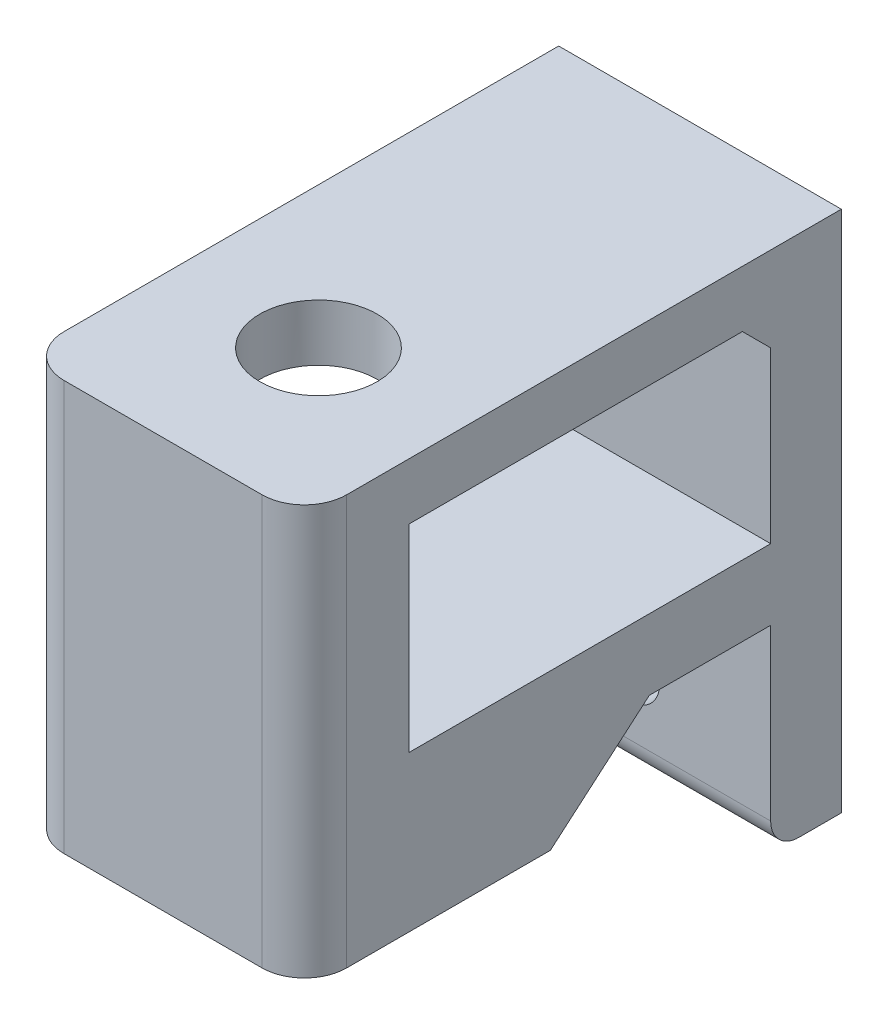
ISO-10303-21;
HEADER;
FILE_DESCRIPTION(('STEP AP214'),'2;1');
FILE_NAME('part.step','',(''),(''),'','','');
FILE_SCHEMA(('AUTOMOTIVE_DESIGN { 1 0 10303 214 1 1 1 1 }'));
ENDSEC;
DATA;
#1=APPLICATION_CONTEXT('core data for automotive mechanical design processes');
#2=APPLICATION_PROTOCOL_DEFINITION('international standard','automotive_design',2000,#1);
#3=PRODUCT_CONTEXT('',#1,'mechanical');
#4=PRODUCT('Part','Part','',(#3));
#5=PRODUCT_RELATED_PRODUCT_CATEGORY('part','',(#4));
#6=PRODUCT_DEFINITION_FORMATION('','',#4);
#7=PRODUCT_DEFINITION_CONTEXT('part definition',#1,'design');
#8=PRODUCT_DEFINITION('design','',#6,#7);
#9=PRODUCT_DEFINITION_SHAPE('','',#8);
#10=(LENGTH_UNIT() NAMED_UNIT(*) SI_UNIT(.MILLI.,.METRE.));
#11=(NAMED_UNIT(*) PLANE_ANGLE_UNIT() SI_UNIT($,.RADIAN.));
#12=(NAMED_UNIT(*) SI_UNIT($,.STERADIAN.) SOLID_ANGLE_UNIT());
#13=UNCERTAINTY_MEASURE_WITH_UNIT(LENGTH_MEASURE(1.E-05),#10,'distance_accuracy_value','');
#14=(GEOMETRIC_REPRESENTATION_CONTEXT(3) GLOBAL_UNCERTAINTY_ASSIGNED_CONTEXT((#13)) GLOBAL_UNIT_ASSIGNED_CONTEXT((#10,
#11,#12)) REPRESENTATION_CONTEXT('',''));
#15=CARTESIAN_POINT('',(0.,0.,0.));
#16=DIRECTION('',(0.,0.,1.));
#17=DIRECTION('',(1.,0.,0.));
#18=AXIS2_PLACEMENT_3D('',#15,#16,#17);
#19=CARTESIAN_POINT('',(10.,-25.7379725676967,27.));
#20=DIRECTION('',(0.,1.,0.));
#21=DIRECTION('',(0.,0.,1.));
#22=AXIS2_PLACEMENT_3D('',#19,#20,#21);
#23=CYLINDRICAL_SURFACE('',#22,4.15);
#24=CARTESIAN_POINT('',(10.,4.,27.));
#25=DIRECTION('',(0.,1.,0.));
#26=DIRECTION('',(0.,0.,1.));
#27=AXIS2_PLACEMENT_3D('',#24,#25,#26);
#28=CIRCLE('',#27,4.15);
#29=CARTESIAN_POINT('',(10.,4.,31.15));
#30=VERTEX_POINT('',#29);
#31=EDGE_CURVE('E208',#30,#30,#28,.T.);
#32=ORIENTED_EDGE('',*,*,#31,.T.);
#33=EDGE_LOOP('',(#32));
#34=FACE_BOUND('',#33,.T.);
#35=DIRECTION('',(0.,1.,0.));
#36=VECTOR('',#35,1.);
#37=CARTESIAN_POINT('',(7.91490464004248,-25.7379725676967,30.5881579312906));
#38=LINE('',#37,#36);
#39=CARTESIAN_POINT('',(7.91490464004248,0.,30.5881579312906));
#40=VERTEX_POINT('',#39);
#41=CARTESIAN_POINT('',(7.91490464004248,-14.,30.5881579312906));
#42=VERTEX_POINT('',#41);
#43=EDGE_CURVE('E203',#40,#42,#38,.F.);
#44=ORIENTED_EDGE('',*,*,#43,.F.);
#45=CARTESIAN_POINT('',(10.,0.,27.));
#46=DIRECTION('',(0.,1.,0.));
#47=DIRECTION('',(0.,0.,1.));
#48=AXIS2_PLACEMENT_3D('',#45,#46,#47);
#49=CIRCLE('',#48,4.15);
#50=CARTESIAN_POINT('',(12.0850953599575,0.,30.5881579312906));
#51=VERTEX_POINT('',#50);
#52=EDGE_CURVE('E11',#40,#51,#49,.F.);
#53=ORIENTED_EDGE('',*,*,#52,.T.);
#54=DIRECTION('',(0.,1.,0.));
#55=VECTOR('',#54,1.);
#56=CARTESIAN_POINT('',(12.0850953599575,-25.7379725676967,30.5881579312906));
#57=LINE('',#56,#55);
#58=CARTESIAN_POINT('',(12.0850953599575,-14.,30.5881579312906));
#59=VERTEX_POINT('',#58);
#60=EDGE_CURVE('E201',#59,#51,#57,.T.);
#61=ORIENTED_EDGE('',*,*,#60,.F.);
#62=CARTESIAN_POINT('',(10.,-14.,27.));
#63=DIRECTION('',(0.,1.,0.));
#64=DIRECTION('',(0.,0.,1.));
#65=AXIS2_PLACEMENT_3D('',#62,#63,#64);
#66=CIRCLE('',#65,4.15);
#67=EDGE_CURVE('E178',#59,#42,#66,.F.);
#68=ORIENTED_EDGE('',*,*,#67,.T.);
#69=EDGE_LOOP('',(#44,#53,#61,#68));
#70=FACE_BOUND('',#69,.T.);
#71=ADVANCED_FACE('F37',(#34,#70),#23,.F.);
#72=CARTESIAN_POINT('',(20.,0.,38.));
#73=DIRECTION('',(0.,-1.,0.));
#74=DIRECTION('',(0.,0.,-1.));
#75=AXIS2_PLACEMENT_3D('',#72,#73,#74);
#76=PLANE('',#75);
#77=DIRECTION('',(0.,0.,-1.));
#78=VECTOR('',#77,1.);
#79=CARTESIAN_POINT('',(20.,0.,38.));
#80=LINE('',#79,#78);
#81=CARTESIAN_POINT('',(20.,0.,30.5881579312906));
#82=VERTEX_POINT('',#81);
#83=CARTESIAN_POINT('',(20.,0.,7.));
#84=VERTEX_POINT('',#83);
#85=EDGE_CURVE('E232',#82,#84,#80,.T.);
#86=ORIENTED_EDGE('',*,*,#85,.F.);
#87=DIRECTION('',(1.,0.,0.));
#88=VECTOR('',#87,1.);
#89=CARTESIAN_POINT('',(20.,0.,30.5881579312906));
#90=LINE('',#89,#88);
#91=EDGE_CURVE('E187',#51,#82,#90,.T.);
#92=ORIENTED_EDGE('',*,*,#91,.F.);
#93=ORIENTED_EDGE('',*,*,#52,.F.);
#94=CARTESIAN_POINT('',(0.,0.,30.5881579312906));
#95=VERTEX_POINT('',#94);
#96=EDGE_CURVE('E198',#95,#40,#90,.T.);
#97=ORIENTED_EDGE('',*,*,#96,.F.);
#98=DIRECTION('',(0.,0.,-1.));
#99=VECTOR('',#98,1.);
#100=CARTESIAN_POINT('',(0.,0.,38.));
#101=LINE('',#100,#99);
#102=CARTESIAN_POINT('',(0.,0.,7.));
#103=VERTEX_POINT('',#102);
#104=EDGE_CURVE('E240',#95,#103,#101,.T.);
#105=ORIENTED_EDGE('',*,*,#104,.T.);
#106=DIRECTION('',(1.,0.,0.));
#107=VECTOR('',#106,1.);
#108=CARTESIAN_POINT('',(20.,0.,7.));
#109=LINE('',#108,#107);
#110=EDGE_CURVE('E305',#103,#84,#109,.T.);
#111=ORIENTED_EDGE('',*,*,#110,.T.);
#112=EDGE_LOOP('',(#86,#92,#93,#97,#105,#111));
#113=FACE_BOUND('',#112,.T.);
#114=ADVANCED_FACE('F327',(#113),#76,.T.);
#115=CARTESIAN_POINT('',(0.,-14.,51.2036860593789));
#116=DIRECTION('',(0.,1.,0.));
#117=DIRECTION('',(0.,0.,1.));
#118=AXIS2_PLACEMENT_3D('',#115,#116,#117);
#119=PLANE('',#118);
#120=DIRECTION('',(0.,0.,-1.));
#121=VECTOR('',#120,1.);
#122=CARTESIAN_POINT('',(0.,-14.,51.2036860593789));
#123=LINE('',#122,#121);
#124=CARTESIAN_POINT('',(0.,-14.,30.5881579312906));
#125=VERTEX_POINT('',#124);
#126=CARTESIAN_POINT('',(0.,-14.,5.));
#127=VERTEX_POINT('',#126);
#128=EDGE_CURVE('E171',#125,#127,#123,.T.);
#129=ORIENTED_EDGE('',*,*,#128,.F.);
#130=DIRECTION('',(-1.,0.,0.));
#131=VECTOR('',#130,1.);
#132=CARTESIAN_POINT('',(20.,-14.,30.5881579312906));
#133=LINE('',#132,#131);
#134=EDGE_CURVE('E182',#42,#125,#133,.T.);
#135=ORIENTED_EDGE('',*,*,#134,.F.);
#136=ORIENTED_EDGE('',*,*,#67,.F.);
#137=CARTESIAN_POINT('',(20.,-14.,30.5881579312906));
#138=VERTEX_POINT('',#137);
#139=EDGE_CURVE('E174',#138,#59,#133,.T.);
#140=ORIENTED_EDGE('',*,*,#139,.F.);
#141=DIRECTION('',(0.,0.,-1.));
#142=VECTOR('',#141,1.);
#143=CARTESIAN_POINT('',(20.,-14.,51.2036860593789));
#144=LINE('',#143,#142);
#145=CARTESIAN_POINT('',(20.,-14.,5.));
#146=VERTEX_POINT('',#145);
#147=EDGE_CURVE('E161',#138,#146,#144,.T.);
#148=ORIENTED_EDGE('',*,*,#147,.T.);
#149=DIRECTION('',(1.,0.,0.));
#150=VECTOR('',#149,1.);
#151=CARTESIAN_POINT('',(0.,-14.,5.));
#152=LINE('',#151,#150);
#153=EDGE_CURVE('E213',#127,#146,#152,.T.);
#154=ORIENTED_EDGE('',*,*,#153,.F.);
#155=EDGE_LOOP('',(#129,#135,#136,#140,#148,#154));
#156=FACE_BOUND('',#155,.T.);
#157=ADVANCED_FACE('F175',(#156),#119,.T.);
#158=CARTESIAN_POINT('',(0.,0.,5.));
#159=DIRECTION('',(0.,0.,1.));
#160=DIRECTION('',(1.,0.,0.));
#161=AXIS2_PLACEMENT_3D('',#158,#159,#160);
#162=PLANE('',#161);
#163=CARTESIAN_POINT('',(10.,-26.5,5.));
#164=DIRECTION('',(0.,0.,1.));
#165=DIRECTION('',(-1.,0.,0.));
#166=AXIS2_PLACEMENT_3D('',#163,#164,#165);
#167=CIRCLE('',#166,2.15);
#168=CARTESIAN_POINT('',(7.85,-26.5,5.));
#169=VERTEX_POINT('',#168);
#170=EDGE_CURVE('E243',#169,#169,#167,.T.);
#171=ORIENTED_EDGE('',*,*,#170,.F.);
#172=EDGE_LOOP('',(#171));
#173=FACE_BOUND('',#172,.T.);
#174=DIRECTION('',(0.,1.,0.));
#175=VECTOR('',#174,1.);
#176=CARTESIAN_POINT('',(20.,0.,5.));
#177=LINE('',#176,#175);
#178=CARTESIAN_POINT('',(20.,-31.,5.));
#179=VERTEX_POINT('',#178);
#180=CARTESIAN_POINT('',(20.,-19.,5.));
#181=VERTEX_POINT('',#180);
#182=EDGE_CURVE('E259',#179,#181,#177,.T.);
#183=ORIENTED_EDGE('',*,*,#182,.T.);
#184=DIRECTION('',(1.,0.,0.));
#185=VECTOR('',#184,1.);
#186=CARTESIAN_POINT('',(0.,-19.,5.));
#187=LINE('',#186,#185);
#188=CARTESIAN_POINT('',(0.,-19.,5.));
#189=VERTEX_POINT('',#188);
#190=EDGE_CURVE('E216',#189,#181,#187,.T.);
#191=ORIENTED_EDGE('',*,*,#190,.F.);
#192=DIRECTION('',(0.,-1.,0.));
#193=VECTOR('',#192,1.);
#194=CARTESIAN_POINT('',(0.,0.,5.));
#195=LINE('',#194,#193);
#196=CARTESIAN_POINT('',(0.,-31.,5.));
#197=VERTEX_POINT('',#196);
#198=EDGE_CURVE('E258',#189,#197,#195,.T.);
#199=ORIENTED_EDGE('',*,*,#198,.T.);
#200=DIRECTION('',(1.,0.,0.));
#201=VECTOR('',#200,1.);
#202=CARTESIAN_POINT('',(20.,-31.,5.));
#203=LINE('',#202,#201);
#204=EDGE_CURVE('E292',#197,#179,#203,.T.);
#205=ORIENTED_EDGE('',*,*,#204,.T.);
#206=EDGE_LOOP('',(#183,#191,#199,#205));
#207=FACE_BOUND('',#206,.T.);
#208=ADVANCED_FACE('F334',(#173,#207),#162,.T.);
#209=ORIENTED_EDGE('',*,*,#153,.T.);
#210=CARTESIAN_POINT('',(20.,-2.00000000000002,5.));
#211=VERTEX_POINT('',#210);
#212=EDGE_CURVE('E167',#146,#211,#177,.T.);
#213=ORIENTED_EDGE('',*,*,#212,.T.);
#214=DIRECTION('',(-1.,0.,0.));
#215=VECTOR('',#214,1.);
#216=CARTESIAN_POINT('',(0.,-2.00000000000002,5.));
#217=LINE('',#216,#215);
#218=CARTESIAN_POINT('',(0.,-2.00000000000002,5.));
#219=VERTEX_POINT('',#218);
#220=EDGE_CURVE('E302',#211,#219,#217,.T.);
#221=ORIENTED_EDGE('',*,*,#220,.T.);
#222=EDGE_CURVE('E255',#219,#127,#195,.T.);
#223=ORIENTED_EDGE('',*,*,#222,.T.);
#224=EDGE_LOOP('',(#209,#213,#221,#223));
#225=FACE_BOUND('',#224,.T.);
#226=CARTESIAN_POINT('',(10.,-6.5,5.));
#227=DIRECTION('',(0.,0.,1.));
#228=DIRECTION('',(1.,0.,0.));
#229=AXIS2_PLACEMENT_3D('',#226,#227,#228);
#230=CIRCLE('',#229,2.15);
#231=CARTESIAN_POINT('',(12.15,-6.5,5.));
#232=VERTEX_POINT('',#231);
#233=EDGE_CURVE('E249',#232,#232,#230,.T.);
#234=ORIENTED_EDGE('',*,*,#233,.F.);
#235=EDGE_LOOP('',(#234));
#236=FACE_BOUND('',#235,.T.);
#237=ADVANCED_FACE('F316',(#225,#236),#162,.T.);
#238=CARTESIAN_POINT('',(0.,0.,0.));
#239=DIRECTION('',(0.,0.,1.));
#240=DIRECTION('',(1.,0.,0.));
#241=AXIS2_PLACEMENT_3D('',#238,#239,#240);
#242=PLANE('',#241);
#243=DIRECTION('',(0.,-1.,0.));
#244=VECTOR('',#243,1.);
#245=CARTESIAN_POINT('',(0.,0.,0.));
#246=LINE('',#245,#244);
#247=CARTESIAN_POINT('',(0.,4.,0.));
#248=VERTEX_POINT('',#247);
#249=CARTESIAN_POINT('',(0.,-33.,0.));
#250=VERTEX_POINT('',#249);
#251=EDGE_CURVE('E252',#248,#250,#246,.T.);
#252=ORIENTED_EDGE('',*,*,#251,.F.);
#253=DIRECTION('',(1.,0.,0.));
#254=VECTOR('',#253,1.);
#255=CARTESIAN_POINT('',(20.,4.,0.));
#256=LINE('',#255,#254);
#257=CARTESIAN_POINT('',(20.,4.,0.));
#258=VERTEX_POINT('',#257);
#259=EDGE_CURVE('E228',#248,#258,#256,.T.);
#260=ORIENTED_EDGE('',*,*,#259,.T.);
#261=DIRECTION('',(0.,1.,0.));
#262=VECTOR('',#261,1.);
#263=CARTESIAN_POINT('',(20.,0.,0.));
#264=LINE('',#263,#262);
#265=CARTESIAN_POINT('',(20.,-33.,0.));
#266=VERTEX_POINT('',#265);
#267=EDGE_CURVE('E268',#266,#258,#264,.T.);
#268=ORIENTED_EDGE('',*,*,#267,.F.);
#269=DIRECTION('',(1.,0.,0.));
#270=VECTOR('',#269,1.);
#271=CARTESIAN_POINT('',(0.,-33.,0.));
#272=LINE('',#271,#270);
#273=EDGE_CURVE('E265',#250,#266,#272,.T.);
#274=ORIENTED_EDGE('',*,*,#273,.F.);
#275=EDGE_LOOP('',(#252,#260,#268,#274));
#276=FACE_BOUND('',#275,.T.);
#277=CARTESIAN_POINT('',(10.,-6.5,0.));
#278=DIRECTION('',(0.,0.,1.));
#279=DIRECTION('',(1.,0.,0.));
#280=AXIS2_PLACEMENT_3D('',#277,#278,#279);
#281=CIRCLE('',#280,2.15);
#282=CARTESIAN_POINT('',(12.15,-6.5,0.));
#283=VERTEX_POINT('',#282);
#284=EDGE_CURVE('E246',#283,#283,#281,.T.);
#285=ORIENTED_EDGE('',*,*,#284,.T.);
#286=EDGE_LOOP('',(#285));
#287=FACE_BOUND('',#286,.T.);
#288=CARTESIAN_POINT('',(10.,-26.5,0.));
#289=DIRECTION('',(0.,0.,1.));
#290=DIRECTION('',(-1.,0.,0.));
#291=AXIS2_PLACEMENT_3D('',#288,#289,#290);
#292=CIRCLE('',#291,2.15);
#293=CARTESIAN_POINT('',(7.85,-26.5,0.));
#294=VERTEX_POINT('',#293);
#295=EDGE_CURVE('E237',#294,#294,#292,.T.);
#296=ORIENTED_EDGE('',*,*,#295,.T.);
#297=EDGE_LOOP('',(#296));
#298=FACE_BOUND('',#297,.T.);
#299=ADVANCED_FACE('F352',(#276,#287,#298),#242,.F.);
#300=CARTESIAN_POINT('',(0.,0.,5.));
#301=DIRECTION('',(1.,0.,0.));
#302=DIRECTION('',(0.,0.,-1.));
#303=AXIS2_PLACEMENT_3D('',#300,#301,#302);
#304=PLANE('',#303);
#305=DIRECTION('',(0.,0.,-1.));
#306=VECTOR('',#305,1.);
#307=CARTESIAN_POINT('',(0.,-19.,51.2036860593789));
#308=LINE('',#307,#306);
#309=CARTESIAN_POINT('',(0.,-19.,13.5881579312906));
#310=VERTEX_POINT('',#309);
#311=EDGE_CURVE('E212',#310,#189,#308,.T.);
#312=ORIENTED_EDGE('',*,*,#311,.F.);
#313=DIRECTION('',(0.,-0.650791373455968,0.759256602365297));
#314=VECTOR('',#313,1.);
#315=CARTESIAN_POINT('',(0.,-25.,20.5881579312906));
#316=LINE('',#315,#314);
#317=CARTESIAN_POINT('',(0.,-25.,20.5881579312906));
#318=VERTEX_POINT('',#317);
#319=EDGE_CURVE('E188',#310,#318,#316,.T.);
#320=ORIENTED_EDGE('',*,*,#319,.T.);
#321=DIRECTION('',(0.,0.,-1.));
#322=VECTOR('',#321,1.);
#323=CARTESIAN_POINT('',(0.,-25.,38.));
#324=LINE('',#323,#322);
#325=CARTESIAN_POINT('',(0.,-25.,35.));
#326=VERTEX_POINT('',#325);
#327=EDGE_CURVE('E215',#326,#318,#324,.T.);
#328=ORIENTED_EDGE('',*,*,#327,.F.);
#329=DIRECTION('',(0.,1.,0.));
#330=VECTOR('',#329,1.);
#331=CARTESIAN_POINT('',(0.,4.,35.));
#332=LINE('',#331,#330);
#333=CARTESIAN_POINT('',(0.,4.,35.));
#334=VERTEX_POINT('',#333);
#335=EDGE_CURVE('E274',#326,#334,#332,.T.);
#336=ORIENTED_EDGE('',*,*,#335,.T.);
#337=DIRECTION('',(0.,0.,-1.));
#338=VECTOR('',#337,1.);
#339=CARTESIAN_POINT('',(0.,4.,38.));
#340=LINE('',#339,#338);
#341=EDGE_CURVE('E238',#334,#248,#340,.T.);
#342=ORIENTED_EDGE('',*,*,#341,.T.);
#343=ORIENTED_EDGE('',*,*,#251,.T.);
#344=DIRECTION('',(0.,0.,-1.));
#345=VECTOR('',#344,1.);
#346=CARTESIAN_POINT('',(0.,-33.,5.));
#347=LINE('',#346,#345);
#348=CARTESIAN_POINT('',(0.,-33.,3.));
#349=VERTEX_POINT('',#348);
#350=EDGE_CURVE('E272',#349,#250,#347,.T.);
#351=ORIENTED_EDGE('',*,*,#350,.F.);
#352=CARTESIAN_POINT('',(0.,-31.,3.));
#353=DIRECTION('',(1.,0.,0.));
#354=DIRECTION('',(0.,0.,-1.));
#355=AXIS2_PLACEMENT_3D('',#352,#353,#354);
#356=CIRCLE('',#355,2.);
#357=EDGE_CURVE('E299',#349,#197,#356,.F.);
#358=ORIENTED_EDGE('',*,*,#357,.T.);
#359=ORIENTED_EDGE('',*,*,#198,.F.);
#360=EDGE_LOOP('',(#312,#320,#328,#336,#342,#343,#351,#358,#359));
#361=FACE_BOUND('',#360,.T.);
#362=ORIENTED_EDGE('',*,*,#104,.F.);
#363=DIRECTION('',(0.,1.,0.));
#364=VECTOR('',#363,1.);
#365=CARTESIAN_POINT('',(0.,0.,30.5881579312906));
#366=LINE('',#365,#364);
#367=EDGE_CURVE('E181',#125,#95,#366,.T.);
#368=ORIENTED_EDGE('',*,*,#367,.F.);
#369=ORIENTED_EDGE('',*,*,#128,.T.);
#370=ORIENTED_EDGE('',*,*,#222,.F.);
#371=DIRECTION('',(0.,-0.707106781186551,-0.707106781186544));
#372=VECTOR('',#371,1.);
#373=CARTESIAN_POINT('',(0.,-0.999999999999998,6.00000000000001));
#374=LINE('',#373,#372);
#375=EDGE_CURVE('E308',#219,#103,#374,.F.);
#376=ORIENTED_EDGE('',*,*,#375,.T.);
#377=EDGE_LOOP('',(#362,#368,#369,#370,#376));
#378=FACE_BOUND('',#377,.T.);
#379=ADVANCED_FACE('F319',(#361,#378),#304,.F.);
#380=CARTESIAN_POINT('',(0.,-33.,5.));
#381=DIRECTION('',(0.,1.,0.));
#382=DIRECTION('',(0.,0.,1.));
#383=AXIS2_PLACEMENT_3D('',#380,#381,#382);
#384=PLANE('',#383);
#385=DIRECTION('',(0.,0.,-1.));
#386=VECTOR('',#385,1.);
#387=CARTESIAN_POINT('',(20.,-33.,5.));
#388=LINE('',#387,#386);
#389=CARTESIAN_POINT('',(20.,-33.,3.));
#390=VERTEX_POINT('',#389);
#391=EDGE_CURVE('E262',#390,#266,#388,.T.);
#392=ORIENTED_EDGE('',*,*,#391,.F.);
#393=DIRECTION('',(1.,0.,0.));
#394=VECTOR('',#393,1.);
#395=CARTESIAN_POINT('',(0.,-33.,3.));
#396=LINE('',#395,#394);
#397=EDGE_CURVE('E297',#390,#349,#396,.F.);
#398=ORIENTED_EDGE('',*,*,#397,.T.);
#399=ORIENTED_EDGE('',*,*,#350,.T.);
#400=ORIENTED_EDGE('',*,*,#273,.T.);
#401=EDGE_LOOP('',(#392,#398,#399,#400));
#402=FACE_BOUND('',#401,.T.);
#403=ADVANCED_FACE('F358',(#402),#384,.F.);
#404=CARTESIAN_POINT('',(20.,0.,5.));
#405=DIRECTION('',(-1.,0.,0.));
#406=DIRECTION('',(0.,0.,1.));
#407=AXIS2_PLACEMENT_3D('',#404,#405,#406);
#408=PLANE('',#407);
#409=DIRECTION('',(0.,0.650791373455968,-0.759256602365297));
#410=VECTOR('',#409,1.);
#411=CARTESIAN_POINT('',(20.,-25.,20.5881579312906));
#412=LINE('',#411,#410);
#413=CARTESIAN_POINT('',(20.,-25.,20.5881579312906));
#414=VERTEX_POINT('',#413);
#415=CARTESIAN_POINT('',(20.,-19.,13.5881579312906));
#416=VERTEX_POINT('',#415);
#417=EDGE_CURVE('E404',#414,#416,#412,.T.);
#418=ORIENTED_EDGE('',*,*,#417,.T.);
#419=DIRECTION('',(0.,0.,-1.));
#420=VECTOR('',#419,1.);
#421=CARTESIAN_POINT('',(20.,-19.,51.2036860593789));
#422=LINE('',#421,#420);
#423=EDGE_CURVE('E58',#416,#181,#422,.T.);
#424=ORIENTED_EDGE('',*,*,#423,.T.);
#425=ORIENTED_EDGE('',*,*,#182,.F.);
#426=CARTESIAN_POINT('',(20.,-31.,3.));
#427=DIRECTION('',(-1.,0.,0.));
#428=DIRECTION('',(0.,0.,1.));
#429=AXIS2_PLACEMENT_3D('',#426,#427,#428);
#430=CIRCLE('',#429,2.);
#431=EDGE_CURVE('E295',#179,#390,#430,.F.);
#432=ORIENTED_EDGE('',*,*,#431,.T.);
#433=ORIENTED_EDGE('',*,*,#391,.T.);
#434=ORIENTED_EDGE('',*,*,#267,.T.);
#435=DIRECTION('',(0.,0.,-1.));
#436=VECTOR('',#435,1.);
#437=CARTESIAN_POINT('',(20.,4.,38.));
#438=LINE('',#437,#436);
#439=CARTESIAN_POINT('',(20.,4.,35.));
#440=VERTEX_POINT('',#439);
#441=EDGE_CURVE('E235',#440,#258,#438,.T.);
#442=ORIENTED_EDGE('',*,*,#441,.F.);
#443=DIRECTION('',(0.,-1.,0.));
#444=VECTOR('',#443,1.);
#445=CARTESIAN_POINT('',(20.,-25.,35.));
#446=LINE('',#445,#444);
#447=CARTESIAN_POINT('',(20.,-25.,35.));
#448=VERTEX_POINT('',#447);
#449=EDGE_CURVE('E289',#440,#448,#446,.T.);
#450=ORIENTED_EDGE('',*,*,#449,.T.);
#451=DIRECTION('',(0.,0.,1.));
#452=VECTOR('',#451,1.);
#453=CARTESIAN_POINT('',(20.,-25.,38.));
#454=LINE('',#453,#452);
#455=EDGE_CURVE('E222',#414,#448,#454,.T.);
#456=ORIENTED_EDGE('',*,*,#455,.F.);
#457=EDGE_LOOP('',(#418,#424,#425,#432,#433,#434,#442,#450,#456));
#458=FACE_BOUND('',#457,.T.);
#459=DIRECTION('',(0.,-1.,0.));
#460=VECTOR('',#459,1.);
#461=CARTESIAN_POINT('',(20.,0.,30.5881579312906));
#462=LINE('',#461,#460);
#463=EDGE_CURVE('E165',#82,#138,#462,.T.);
#464=ORIENTED_EDGE('',*,*,#463,.F.);
#465=ORIENTED_EDGE('',*,*,#85,.T.);
#466=DIRECTION('',(0.,0.707106781186551,0.707106781186544));
#467=VECTOR('',#466,1.);
#468=CARTESIAN_POINT('',(20.,-0.999999999999998,6.00000000000001));
#469=LINE('',#468,#467);
#470=EDGE_CURVE('E46',#84,#211,#469,.F.);
#471=ORIENTED_EDGE('',*,*,#470,.T.);
#472=ORIENTED_EDGE('',*,*,#212,.F.);
#473=ORIENTED_EDGE('',*,*,#147,.F.);
#474=EDGE_LOOP('',(#464,#465,#471,#472,#473));
#475=FACE_BOUND('',#474,.T.);
#476=ADVANCED_FACE('F163',(#458,#475),#408,.F.);
#477=CARTESIAN_POINT('',(10.,-6.5,5.));
#478=DIRECTION('',(0.,0.,-1.));
#479=DIRECTION('',(-1.,0.,0.));
#480=AXIS2_PLACEMENT_3D('',#477,#478,#479);
#481=CYLINDRICAL_SURFACE('',#480,2.15);
#482=ORIENTED_EDGE('',*,*,#233,.T.);
#483=EDGE_LOOP('',(#482));
#484=FACE_BOUND('',#483,.T.);
#485=ORIENTED_EDGE('',*,*,#284,.F.);
#486=EDGE_LOOP('',(#485));
#487=FACE_BOUND('',#486,.T.);
#488=ADVANCED_FACE('F345',(#484,#487),#481,.F.);
#489=CARTESIAN_POINT('',(10.,-26.5,5.));
#490=DIRECTION('',(0.,0.,-1.));
#491=DIRECTION('',(-1.,0.,0.));
#492=AXIS2_PLACEMENT_3D('',#489,#490,#491);
#493=CYLINDRICAL_SURFACE('',#492,2.15);
#494=ORIENTED_EDGE('',*,*,#170,.T.);
#495=EDGE_LOOP('',(#494));
#496=FACE_BOUND('',#495,.T.);
#497=ORIENTED_EDGE('',*,*,#295,.F.);
#498=EDGE_LOOP('',(#497));
#499=FACE_BOUND('',#498,.T.);
#500=ADVANCED_FACE('F342',(#496,#499),#493,.F.);
#501=CARTESIAN_POINT('',(20.,4.,38.));
#502=DIRECTION('',(0.,1.,0.));
#503=DIRECTION('',(0.,0.,1.));
#504=AXIS2_PLACEMENT_3D('',#501,#502,#503);
#505=PLANE('',#504);
#506=ORIENTED_EDGE('',*,*,#31,.F.);
#507=EDGE_LOOP('',(#506));
#508=FACE_BOUND('',#507,.T.);
#509=ORIENTED_EDGE('',*,*,#341,.F.);
#510=CARTESIAN_POINT('',(3.,4.,35.));
#511=DIRECTION('',(0.,1.,0.));
#512=DIRECTION('',(0.,0.,1.));
#513=AXIS2_PLACEMENT_3D('',#510,#511,#512);
#514=CIRCLE('',#513,3.);
#515=CARTESIAN_POINT('',(3.,4.,38.));
#516=VERTEX_POINT('',#515);
#517=EDGE_CURVE('E279',#334,#516,#514,.T.);
#518=ORIENTED_EDGE('',*,*,#517,.T.);
#519=DIRECTION('',(1.,0.,0.));
#520=VECTOR('',#519,1.);
#521=CARTESIAN_POINT('',(20.,4.,38.));
#522=LINE('',#521,#520);
#523=CARTESIAN_POINT('',(17.,4.,38.));
#524=VERTEX_POINT('',#523);
#525=EDGE_CURVE('E229',#516,#524,#522,.T.);
#526=ORIENTED_EDGE('',*,*,#525,.T.);
#527=CARTESIAN_POINT('',(17.,4.,35.));
#528=DIRECTION('',(0.,1.,0.));
#529=DIRECTION('',(0.,0.,1.));
#530=AXIS2_PLACEMENT_3D('',#527,#528,#529);
#531=CIRCLE('',#530,3.);
#532=EDGE_CURVE('E277',#524,#440,#531,.T.);
#533=ORIENTED_EDGE('',*,*,#532,.T.);
#534=ORIENTED_EDGE('',*,*,#441,.T.);
#535=ORIENTED_EDGE('',*,*,#259,.F.);
#536=EDGE_LOOP('',(#509,#518,#526,#533,#534,#535));
#537=FACE_BOUND('',#536,.T.);
#538=ADVANCED_FACE('F340',(#508,#537),#505,.T.);
#539=CARTESIAN_POINT('',(0.,0.,38.));
#540=DIRECTION('',(0.,0.,1.));
#541=DIRECTION('',(1.,0.,0.));
#542=AXIS2_PLACEMENT_3D('',#539,#540,#541);
#543=PLANE('',#542);
#544=ORIENTED_EDGE('',*,*,#525,.F.);
#545=DIRECTION('',(0.,1.,0.));
#546=VECTOR('',#545,1.);
#547=CARTESIAN_POINT('',(3.,-25.,38.));
#548=LINE('',#547,#546);
#549=CARTESIAN_POINT('',(3.,-25.,38.));
#550=VERTEX_POINT('',#549);
#551=EDGE_CURVE('E283',#516,#550,#548,.F.);
#552=ORIENTED_EDGE('',*,*,#551,.T.);
#553=DIRECTION('',(-1.,0.,0.));
#554=VECTOR('',#553,1.);
#555=CARTESIAN_POINT('',(0.,-25.,38.));
#556=LINE('',#555,#554);
#557=CARTESIAN_POINT('',(17.,-25.,38.));
#558=VERTEX_POINT('',#557);
#559=EDGE_CURVE('E225',#558,#550,#556,.T.);
#560=ORIENTED_EDGE('',*,*,#559,.F.);
#561=DIRECTION('',(0.,-1.,0.));
#562=VECTOR('',#561,1.);
#563=CARTESIAN_POINT('',(17.,4.,38.));
#564=LINE('',#563,#562);
#565=EDGE_CURVE('E281',#558,#524,#564,.F.);
#566=ORIENTED_EDGE('',*,*,#565,.T.);
#567=EDGE_LOOP('',(#544,#552,#560,#566));
#568=FACE_BOUND('',#567,.T.);
#569=ADVANCED_FACE('F414',(#568),#543,.T.);
#570=CARTESIAN_POINT('',(0.,-25.,0.));
#571=DIRECTION('',(0.,-1.,0.));
#572=DIRECTION('',(0.,0.,-1.));
#573=AXIS2_PLACEMENT_3D('',#570,#571,#572);
#574=PLANE('',#573);
#575=ORIENTED_EDGE('',*,*,#559,.T.);
#576=CARTESIAN_POINT('',(3.,-25.,35.));
#577=DIRECTION('',(0.,-1.,0.));
#578=DIRECTION('',(0.,0.,-1.));
#579=AXIS2_PLACEMENT_3D('',#576,#577,#578);
#580=CIRCLE('',#579,3.);
#581=EDGE_CURVE('E287',#550,#326,#580,.T.);
#582=ORIENTED_EDGE('',*,*,#581,.T.);
#583=ORIENTED_EDGE('',*,*,#327,.T.);
#584=DIRECTION('',(-1.,0.,0.));
#585=VECTOR('',#584,1.);
#586=CARTESIAN_POINT('',(0.,-25.,20.5881579312906));
#587=LINE('',#586,#585);
#588=EDGE_CURVE('E205',#414,#318,#587,.T.);
#589=ORIENTED_EDGE('',*,*,#588,.F.);
#590=ORIENTED_EDGE('',*,*,#455,.T.);
#591=CARTESIAN_POINT('',(17.,-25.,35.));
#592=DIRECTION('',(0.,-1.,0.));
#593=DIRECTION('',(0.,0.,-1.));
#594=AXIS2_PLACEMENT_3D('',#591,#592,#593);
#595=CIRCLE('',#594,3.);
#596=EDGE_CURVE('E285',#448,#558,#595,.T.);
#597=ORIENTED_EDGE('',*,*,#596,.T.);
#598=EDGE_LOOP('',(#575,#582,#583,#589,#590,#597));
#599=FACE_BOUND('',#598,.T.);
#600=ADVANCED_FACE('F370',(#599),#574,.T.);
#601=CARTESIAN_POINT('',(3.,0.,35.));
#602=DIRECTION('',(0.,-1.,0.));
#603=DIRECTION('',(0.,0.,-1.));
#604=AXIS2_PLACEMENT_3D('',#601,#602,#603);
#605=CYLINDRICAL_SURFACE('',#604,3.);
#606=ORIENTED_EDGE('',*,*,#581,.F.);
#607=ORIENTED_EDGE('',*,*,#551,.F.);
#608=ORIENTED_EDGE('',*,*,#517,.F.);
#609=ORIENTED_EDGE('',*,*,#335,.F.);
#610=EDGE_LOOP('',(#606,#607,#608,#609));
#611=FACE_BOUND('',#610,.T.);
#612=ADVANCED_FACE('F366',(#611),#605,.T.);
#613=CARTESIAN_POINT('',(17.,0.,35.));
#614=DIRECTION('',(0.,1.,0.));
#615=DIRECTION('',(0.,0.,1.));
#616=AXIS2_PLACEMENT_3D('',#613,#614,#615);
#617=CYLINDRICAL_SURFACE('',#616,3.);
#618=ORIENTED_EDGE('',*,*,#532,.F.);
#619=ORIENTED_EDGE('',*,*,#565,.F.);
#620=ORIENTED_EDGE('',*,*,#596,.F.);
#621=ORIENTED_EDGE('',*,*,#449,.F.);
#622=EDGE_LOOP('',(#618,#619,#620,#621));
#623=FACE_BOUND('',#622,.T.);
#624=ADVANCED_FACE('F369',(#623),#617,.T.);
#625=CARTESIAN_POINT('',(0.,-31.,3.));
#626=DIRECTION('',(-1.,0.,0.));
#627=DIRECTION('',(0.,0.,1.));
#628=AXIS2_PLACEMENT_3D('',#625,#626,#627);
#629=CYLINDRICAL_SURFACE('',#628,2.);
#630=ORIENTED_EDGE('',*,*,#357,.F.);
#631=ORIENTED_EDGE('',*,*,#397,.F.);
#632=ORIENTED_EDGE('',*,*,#431,.F.);
#633=ORIENTED_EDGE('',*,*,#204,.F.);
#634=EDGE_LOOP('',(#630,#631,#632,#633));
#635=FACE_BOUND('',#634,.T.);
#636=ADVANCED_FACE('F373',(#635),#629,.T.);
#637=CARTESIAN_POINT('',(0.,-2.00000000000002,5.));
#638=DIRECTION('',(0.,-0.707106781186544,0.707106781186551));
#639=DIRECTION('',(1.,0.,0.));
#640=AXIS2_PLACEMENT_3D('',#637,#638,#639);
#641=PLANE('',#640);
#642=ORIENTED_EDGE('',*,*,#470,.F.);
#643=ORIENTED_EDGE('',*,*,#110,.F.);
#644=ORIENTED_EDGE('',*,*,#375,.F.);
#645=ORIENTED_EDGE('',*,*,#220,.F.);
#646=EDGE_LOOP('',(#642,#643,#644,#645));
#647=FACE_BOUND('',#646,.T.);
#648=ADVANCED_FACE('F40',(#647),#641,.T.);
#649=CARTESIAN_POINT('',(0.,-19.,51.2036860593789));
#650=DIRECTION('',(0.,1.,0.));
#651=DIRECTION('',(0.,0.,1.));
#652=AXIS2_PLACEMENT_3D('',#649,#650,#651);
#653=PLANE('',#652);
#654=ORIENTED_EDGE('',*,*,#423,.F.);
#655=DIRECTION('',(1.,0.,0.));
#656=VECTOR('',#655,1.);
#657=CARTESIAN_POINT('',(-9.21954445729289,-19.,13.5881579312906));
#658=LINE('',#657,#656);
#659=EDGE_CURVE('E53',#310,#416,#658,.T.);
#660=ORIENTED_EDGE('',*,*,#659,.F.);
#661=ORIENTED_EDGE('',*,*,#311,.T.);
#662=ORIENTED_EDGE('',*,*,#190,.T.);
#663=EDGE_LOOP('',(#654,#660,#661,#662));
#664=FACE_BOUND('',#663,.T.);
#665=ADVANCED_FACE('F380',(#664),#653,.F.);
#666=CARTESIAN_POINT('',(0.,0.,30.5881579312906));
#667=DIRECTION('',(0.,0.,-1.));
#668=DIRECTION('',(-1.,0.,0.));
#669=AXIS2_PLACEMENT_3D('',#666,#667,#668);
#670=PLANE('',#669);
#671=ORIENTED_EDGE('',*,*,#43,.T.);
#672=ORIENTED_EDGE('',*,*,#134,.T.);
#673=ORIENTED_EDGE('',*,*,#367,.T.);
#674=ORIENTED_EDGE('',*,*,#96,.T.);
#675=EDGE_LOOP('',(#671,#672,#673,#674));
#676=FACE_BOUND('',#675,.T.);
#677=ADVANCED_FACE('F322',(#676),#670,.T.);
#678=ORIENTED_EDGE('',*,*,#60,.T.);
#679=ORIENTED_EDGE('',*,*,#91,.T.);
#680=ORIENTED_EDGE('',*,*,#463,.T.);
#681=ORIENTED_EDGE('',*,*,#139,.T.);
#682=EDGE_LOOP('',(#678,#679,#680,#681));
#683=FACE_BOUND('',#682,.T.);
#684=ADVANCED_FACE('F185',(#683),#670,.T.);
#685=CARTESIAN_POINT('',(-9.21954445729289,-25.,20.5881579312906));
#686=DIRECTION('',(0.,-0.759256602365296,-0.650791373455968));
#687=DIRECTION('',(0.,0.650791373455968,-0.759256602365297));
#688=AXIS2_PLACEMENT_3D('',#685,#686,#687);
#689=PLANE('',#688);
#690=ORIENTED_EDGE('',*,*,#319,.F.);
#691=ORIENTED_EDGE('',*,*,#659,.T.);
#692=ORIENTED_EDGE('',*,*,#417,.F.);
#693=ORIENTED_EDGE('',*,*,#588,.T.);
#694=EDGE_LOOP('',(#690,#691,#692,#693));
#695=FACE_BOUND('',#694,.T.);
#696=ADVANCED_FACE('F401',(#695),#689,.T.);
#697=CLOSED_SHELL('',(#71,#114,#157,#208,#237,#299,#379,#403,#476,#488,#500,#538,#569,#600,#612,
#624,#636,#648,#665,#677,#684,#696));
#698=MANIFOLD_SOLID_BREP('B2',#697);
#699=ADVANCED_BREP_SHAPE_REPRESENTATION('',(#18,#698),#14);
#700=SHAPE_DEFINITION_REPRESENTATION(#9,#699);
ENDSEC;
END-ISO-10303-21;
